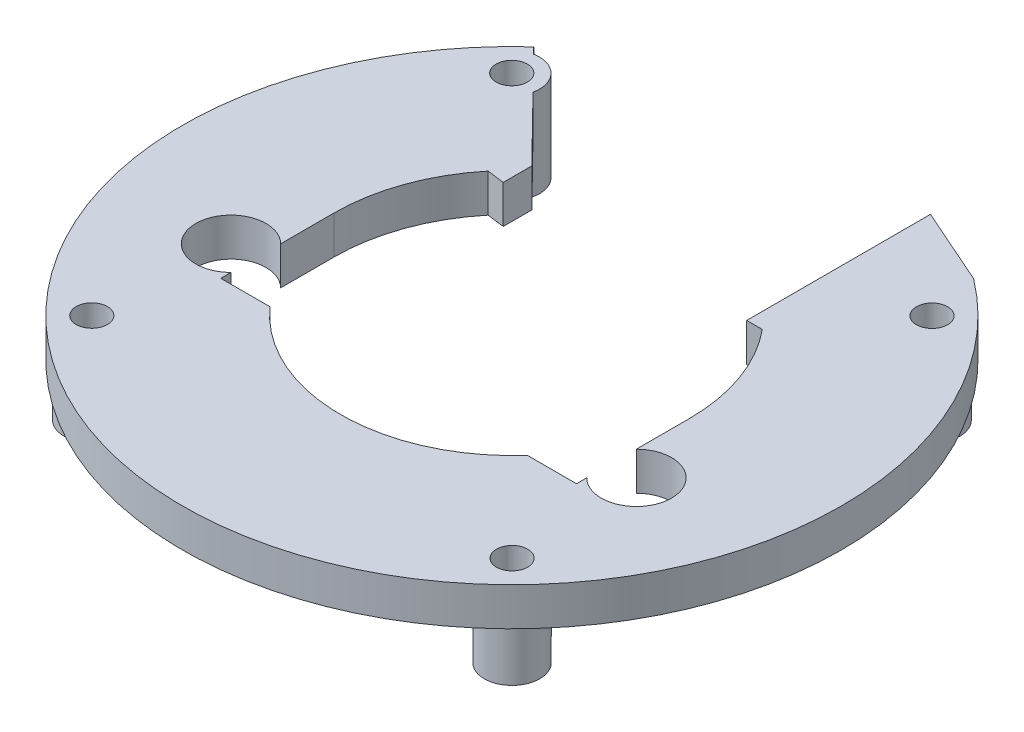
ISO-10303-21;
HEADER;
FILE_DESCRIPTION(('STEP AP214'),'2;1');
FILE_NAME('part.step','',(''),(''),'','','');
FILE_SCHEMA(('AUTOMOTIVE_DESIGN { 1 0 10303 214 1 1 1 1 }'));
ENDSEC;
DATA;
#1=APPLICATION_CONTEXT('core data for automotive mechanical design processes');
#2=APPLICATION_PROTOCOL_DEFINITION('international standard','automotive_design',2000,#1);
#3=PRODUCT_CONTEXT('',#1,'mechanical');
#4=PRODUCT('Part','Part','',(#3));
#5=PRODUCT_RELATED_PRODUCT_CATEGORY('part','',(#4));
#6=PRODUCT_DEFINITION_FORMATION('','',#4);
#7=PRODUCT_DEFINITION_CONTEXT('part definition',#1,'design');
#8=PRODUCT_DEFINITION('design','',#6,#7);
#9=PRODUCT_DEFINITION_SHAPE('','',#8);
#10=(LENGTH_UNIT() NAMED_UNIT(*) SI_UNIT(.MILLI.,.METRE.));
#11=(NAMED_UNIT(*) PLANE_ANGLE_UNIT() SI_UNIT($,.RADIAN.));
#12=(NAMED_UNIT(*) SI_UNIT($,.STERADIAN.) SOLID_ANGLE_UNIT());
#13=UNCERTAINTY_MEASURE_WITH_UNIT(LENGTH_MEASURE(1.E-05),#10,'distance_accuracy_value','');
#14=(GEOMETRIC_REPRESENTATION_CONTEXT(3) GLOBAL_UNCERTAINTY_ASSIGNED_CONTEXT((#13)) GLOBAL_UNIT_ASSIGNED_CONTEXT((#10,
#11,#12)) REPRESENTATION_CONTEXT('',''));
#15=CARTESIAN_POINT('',(0.,0.,0.));
#16=DIRECTION('',(0.,0.,1.));
#17=DIRECTION('',(1.,0.,0.));
#18=AXIS2_PLACEMENT_3D('',#15,#16,#17);
#19=CARTESIAN_POINT('',(0.,-5.588,0.));
#20=DIRECTION('',(0.,1.,0.));
#21=DIRECTION('',(0.,0.,1.));
#22=AXIS2_PLACEMENT_3D('',#19,#20,#21);
#23=PLANE('',#22);
#24=CARTESIAN_POINT('',(-30.7594,-5.588,30.7411010296903));
#25=DIRECTION('',(0.,1.,0.));
#26=DIRECTION('',(0.,0.,1.));
#27=AXIS2_PLACEMENT_3D('',#24,#25,#26);
#28=CIRCLE('',#27,4.06400000000001);
#29=CARTESIAN_POINT('',(-30.7594,-5.588,34.8051010296903));
#30=VERTEX_POINT('',#29);
#31=EDGE_CURVE('E533',#30,#30,#28,.F.);
#32=ORIENTED_EDGE('',*,*,#31,.F.);
#33=EDGE_LOOP('',(#32));
#34=FACE_BOUND('',#33,.T.);
#35=DIRECTION('',(-0.700354867966116,0.,-0.713794829706804));
#36=VECTOR('',#35,1.);
#37=CARTESIAN_POINT('',(1.28776269894874,-5.588,-1.26351556141755));
#38=LINE('',#37,#36);
#39=CARTESIAN_POINT('',(-31.5467271734712,-5.588,-34.7281064124198));
#40=VERTEX_POINT('',#39);
#41=CARTESIAN_POINT('',(-32.4776887690565,-5.588,-35.6769333628402));
#42=VERTEX_POINT('',#41);
#43=EDGE_CURVE('E458',#40,#42,#38,.T.);
#44=ORIENTED_EDGE('',*,*,#43,.F.);
#45=CARTESIAN_POINT('',(-30.7594,-5.588,-30.7411010296903));
#46=DIRECTION('',(0.,1.,0.));
#47=DIRECTION('',(0.,0.,1.));
#48=AXIS2_PLACEMENT_3D('',#45,#46,#47);
#49=CIRCLE('',#48,4.06400000000001);
#50=CARTESIAN_POINT('',(-26.7880788333373,-5.588,-29.8781385790488));
#51=VERTEX_POINT('',#50);
#52=EDGE_CURVE('E666',#40,#51,#49,.T.);
#53=ORIENTED_EDGE('',*,*,#52,.T.);
#54=CARTESIAN_POINT('',(-17.5260000000037,-5.588,-20.4383184450504));
#55=VERTEX_POINT('',#54);
#56=EDGE_CURVE('E459',#55,#51,#38,.T.);
#57=ORIENTED_EDGE('',*,*,#56,.F.);
#58=DIRECTION('',(0.,0.,1.));
#59=VECTOR('',#58,1.);
#60=CARTESIAN_POINT('',(-17.5260000000037,-5.588,0.));
#61=LINE('',#60,#59);
#62=CARTESIAN_POINT('',(-17.5260000000037,-5.588,-16.256));
#63=VERTEX_POINT('',#62);
#64=EDGE_CURVE('E456',#55,#63,#61,.T.);
#65=ORIENTED_EDGE('',*,*,#64,.T.);
#66=DIRECTION('',(-0.992032593835348,0.,-0.125981477877945));
#67=VECTOR('',#66,1.);
#68=CARTESIAN_POINT('',(1.75347703775627,-5.588,-13.8076358786755));
#69=LINE('',#68,#67);
#70=CARTESIAN_POINT('',(-20.0733983735918,-5.588,-16.5795024875622));
#71=VERTEX_POINT('',#70);
#72=EDGE_CURVE('E454',#63,#71,#69,.T.);
#73=ORIENTED_EDGE('',*,*,#72,.T.);
#74=CARTESIAN_POINT('',(0.,-5.588,0.));
#75=DIRECTION('',(0.,1.,0.));
#76=DIRECTION('',(0.,0.,1.));
#77=AXIS2_PLACEMENT_3D('',#74,#75,#76);
#78=CIRCLE('',#77,26.035);
#79=CARTESIAN_POINT('',(-26.035,-5.588,0.));
#80=VERTEX_POINT('',#79);
#81=EDGE_CURVE('E449',#71,#80,#78,.T.);
#82=ORIENTED_EDGE('',*,*,#81,.T.);
#83=DIRECTION('',(0.,0.,1.));
#84=VECTOR('',#83,1.);
#85=CARTESIAN_POINT('',(-26.035,-5.588,0.));
#86=LINE('',#85,#84);
#87=CARTESIAN_POINT('',(-26.035,-5.588,7.8211488360114));
#88=VERTEX_POINT('',#87);
#89=EDGE_CURVE('E446',#80,#88,#86,.T.);
#90=ORIENTED_EDGE('',*,*,#89,.T.);
#91=CARTESIAN_POINT('',(-29.6799,-5.588,11.4502391132021));
#92=DIRECTION('',(0.,1.,0.));
#93=DIRECTION('',(0.,0.,1.));
#94=AXIS2_PLACEMENT_3D('',#91,#92,#93);
#95=CIRCLE('',#94,5.1435);
#96=CARTESIAN_POINT('',(-26.035,-5.588,15.0793293903928));
#97=VERTEX_POINT('',#96);
#98=EDGE_CURVE('E428',#97,#88,#95,.F.);
#99=ORIENTED_EDGE('',*,*,#98,.F.);
#100=DIRECTION('',(0.,0.,1.));
#101=VECTOR('',#100,1.);
#102=CARTESIAN_POINT('',(-26.035,-5.588,0.));
#103=LINE('',#102,#101);
#104=CARTESIAN_POINT('',(-26.035,-5.588,16.5795024875622));
#105=VERTEX_POINT('',#104);
#106=EDGE_CURVE('E437',#97,#105,#103,.T.);
#107=ORIENTED_EDGE('',*,*,#106,.T.);
#108=DIRECTION('',(-1.,0.,0.));
#109=VECTOR('',#108,1.);
#110=CARTESIAN_POINT('',(0.,-5.588,16.5795024875621));
#111=LINE('',#110,#109);
#112=CARTESIAN_POINT('',(-18.8224240925247,-5.588,16.5795024875622));
#113=VERTEX_POINT('',#112);
#114=EDGE_CURVE('E435',#113,#105,#111,.T.);
#115=ORIENTED_EDGE('',*,*,#114,.F.);
#116=CARTESIAN_POINT('',(0.,-5.588,0.));
#117=DIRECTION('',(0.,1.,0.));
#118=DIRECTION('',(0.,0.,1.));
#119=AXIS2_PLACEMENT_3D('',#116,#117,#118);
#120=CIRCLE('',#119,25.083132807804);
#121=CARTESIAN_POINT('',(18.8224240925247,-5.588,16.5795024875622));
#122=VERTEX_POINT('',#121);
#123=EDGE_CURVE('E484',#113,#122,#120,.T.);
#124=ORIENTED_EDGE('',*,*,#123,.T.);
#125=DIRECTION('',(-1.,0.,0.));
#126=VECTOR('',#125,1.);
#127=CARTESIAN_POINT('',(0.,-5.588,16.5795024875622));
#128=LINE('',#127,#126);
#129=CARTESIAN_POINT('',(26.035,-5.588,16.5795024875622));
#130=VERTEX_POINT('',#129);
#131=EDGE_CURVE('E481',#130,#122,#128,.T.);
#132=ORIENTED_EDGE('',*,*,#131,.F.);
#133=DIRECTION('',(0.,0.,1.));
#134=VECTOR('',#133,1.);
#135=CARTESIAN_POINT('',(26.035,-5.588,0.));
#136=LINE('',#135,#134);
#137=CARTESIAN_POINT('',(26.035,-5.588,15.0793293903928));
#138=VERTEX_POINT('',#137);
#139=EDGE_CURVE('E478',#138,#130,#136,.T.);
#140=ORIENTED_EDGE('',*,*,#139,.F.);
#141=CARTESIAN_POINT('',(29.6799,-5.588,11.4502391132021));
#142=DIRECTION('',(0.,1.,0.));
#143=DIRECTION('',(0.,0.,1.));
#144=AXIS2_PLACEMENT_3D('',#141,#142,#143);
#145=CIRCLE('',#144,5.14350000000001);
#146=CARTESIAN_POINT('',(26.035,-5.588,7.8211488360114));
#147=VERTEX_POINT('',#146);
#148=EDGE_CURVE('E476',#138,#147,#145,.T.);
#149=ORIENTED_EDGE('',*,*,#148,.T.);
#150=DIRECTION('',(0.,0.,1.));
#151=VECTOR('',#150,1.);
#152=CARTESIAN_POINT('',(26.035,-5.588,0.));
#153=LINE('',#152,#151);
#154=CARTESIAN_POINT('',(26.035,-5.588,0.));
#155=VERTEX_POINT('',#154);
#156=EDGE_CURVE('E473',#155,#147,#153,.T.);
#157=ORIENTED_EDGE('',*,*,#156,.F.);
#158=CARTESIAN_POINT('',(0.,-5.588,0.));
#159=DIRECTION('',(0.,1.,0.));
#160=DIRECTION('',(0.,0.,1.));
#161=AXIS2_PLACEMENT_3D('',#158,#159,#160);
#162=CIRCLE('',#161,26.035);
#163=CARTESIAN_POINT('',(20.0733983735918,-5.588,-16.5795024875622));
#164=VERTEX_POINT('',#163);
#165=EDGE_CURVE('E471',#155,#164,#162,.T.);
#166=ORIENTED_EDGE('',*,*,#165,.T.);
#167=DIRECTION('',(-1.,0.,0.));
#168=VECTOR('',#167,1.);
#169=CARTESIAN_POINT('',(0.,-5.588,-16.5795024875622));
#170=LINE('',#169,#168);
#171=CARTESIAN_POINT('',(17.7906760658379,-5.588,-16.5795024875622));
#172=VERTEX_POINT('',#171);
#173=EDGE_CURVE('E469',#164,#172,#170,.T.);
#174=ORIENTED_EDGE('',*,*,#173,.T.);
#175=DIRECTION('',(0.,0.,-1.));
#176=VECTOR('',#175,1.);
#177=CARTESIAN_POINT('',(17.7906760658379,-5.588,0.));
#178=LINE('',#177,#176);
#179=CARTESIAN_POINT('',(17.7906760658379,-5.588,-43.4830360129035));
#180=VERTEX_POINT('',#179);
#181=EDGE_CURVE('E467',#172,#180,#178,.T.);
#182=ORIENTED_EDGE('',*,*,#181,.T.);
#183=DIRECTION('',(0.914664910906145,0.,0.404212939868399));
#184=VECTOR('',#183,1.);
#185=CARTESIAN_POINT('',(18.9833064380603,-5.588,-42.955983293176));
#186=LINE('',#185,#184);
#187=CARTESIAN_POINT('',(29.0886532750842,-5.588,-38.4901817688379));
#188=VERTEX_POINT('',#187);
#189=EDGE_CURVE('E465',#180,#188,#186,.T.);
#190=ORIENTED_EDGE('',*,*,#189,.T.);
#191=CARTESIAN_POINT('',(0.,-5.588,0.));
#192=DIRECTION('',(0.,1.,0.));
#193=DIRECTION('',(0.,0.,1.));
#194=AXIS2_PLACEMENT_3D('',#191,#192,#193);
#195=CIRCLE('',#194,48.2456613796126);
#196=EDGE_CURVE('E462',#42,#188,#195,.T.);
#197=ORIENTED_EDGE('',*,*,#196,.F.);
#198=EDGE_LOOP('',(#44,#53,#57,#65,#73,#82,#90,#99,#107,#115,#124,#132,#140,#149,#157,#166,#174,
#182,#190,#197));
#199=FACE_BOUND('',#198,.T.);
#200=CARTESIAN_POINT('',(30.7594,-5.588,30.7411010296903));
#201=DIRECTION('',(0.,1.,0.));
#202=DIRECTION('',(0.,0.,1.));
#203=AXIS2_PLACEMENT_3D('',#200,#201,#202);
#204=CIRCLE('',#203,4.06400000000001);
#205=CARTESIAN_POINT('',(30.7594,-5.588,34.8051010296903));
#206=VERTEX_POINT('',#205);
#207=EDGE_CURVE('E689',#206,#206,#204,.T.);
#208=ORIENTED_EDGE('',*,*,#207,.T.);
#209=EDGE_LOOP('',(#208));
#210=FACE_BOUND('',#209,.T.);
#211=CARTESIAN_POINT('',(30.7594,-5.588,-30.7411010296903));
#212=DIRECTION('',(0.,1.,0.));
#213=DIRECTION('',(0.,0.,1.));
#214=AXIS2_PLACEMENT_3D('',#211,#212,#213);
#215=CIRCLE('',#214,4.06400000000001);
#216=CARTESIAN_POINT('',(30.7594,-5.588,-26.6771010296903));
#217=VERTEX_POINT('',#216);
#218=EDGE_CURVE('E297',#217,#217,#215,.F.);
#219=ORIENTED_EDGE('',*,*,#218,.F.);
#220=EDGE_LOOP('',(#219));
#221=FACE_BOUND('',#220,.T.);
#222=ADVANCED_FACE('F289',(#34,#199,#210,#221),#23,.F.);
#223=CARTESIAN_POINT('',(1.28776269894874,-5.588,-1.26351556141755));
#224=DIRECTION('',(0.713794829706803,0.,-0.700354867966116));
#225=DIRECTION('',(-0.700354867966116,0.,-0.713794829706804));
#226=AXIS2_PLACEMENT_3D('',#223,#224,#225);
#227=PLANE('',#226);
#228=DIRECTION('',(0.,1.,0.));
#229=VECTOR('',#228,1.);
#230=CARTESIAN_POINT('',(-31.5467271734712,-13.2588,-34.7281064124198));
#231=LINE('',#230,#229);
#232=CARTESIAN_POINT('',(-31.5467271734712,0.,-34.7281064124198));
#233=VERTEX_POINT('',#232);
#234=EDGE_CURVE('E304',#40,#233,#231,.T.);
#235=ORIENTED_EDGE('',*,*,#234,.F.);
#236=ORIENTED_EDGE('',*,*,#43,.T.);
#237=DIRECTION('',(0.,1.,0.));
#238=VECTOR('',#237,1.);
#239=CARTESIAN_POINT('',(-32.4776887690565,-5.588,-35.6769333628402));
#240=LINE('',#239,#238);
#241=CARTESIAN_POINT('',(-32.4776887690565,0.,-35.6769333628402));
#242=VERTEX_POINT('',#241);
#243=EDGE_CURVE('E557',#42,#242,#240,.T.);
#244=ORIENTED_EDGE('',*,*,#243,.T.);
#245=DIRECTION('',(-0.700354867966116,0.,-0.713794829706804));
#246=VECTOR('',#245,1.);
#247=CARTESIAN_POINT('',(1.28776269894874,0.,-1.26351556141755));
#248=LINE('',#247,#246);
#249=EDGE_CURVE('E309',#233,#242,#248,.T.);
#250=ORIENTED_EDGE('',*,*,#249,.F.);
#251=EDGE_LOOP('',(#235,#236,#244,#250));
#252=FACE_BOUND('',#251,.T.);
#253=ADVANCED_FACE('F630',(#252),#227,.T.);
#254=CARTESIAN_POINT('',(0.,0.,0.));
#255=DIRECTION('',(0.,1.,0.));
#256=DIRECTION('',(0.,0.,1.));
#257=AXIS2_PLACEMENT_3D('',#254,#255,#256);
#258=PLANE('',#257);
#259=CARTESIAN_POINT('',(-30.7594,0.,-30.7411010296903));
#260=DIRECTION('',(0.,1.,0.));
#261=DIRECTION('',(0.,0.,1.));
#262=AXIS2_PLACEMENT_3D('',#259,#260,#261);
#263=CIRCLE('',#262,4.06400000000001);
#264=CARTESIAN_POINT('',(-26.7880788333373,0.,-29.8781385790488));
#265=VERTEX_POINT('',#264);
#266=EDGE_CURVE('E659',#265,#233,#263,.T.);
#267=ORIENTED_EDGE('',*,*,#266,.T.);
#268=ORIENTED_EDGE('',*,*,#249,.T.);
#269=CARTESIAN_POINT('',(0.,0.,0.));
#270=DIRECTION('',(0.,1.,0.));
#271=DIRECTION('',(0.,0.,1.));
#272=AXIS2_PLACEMENT_3D('',#269,#270,#271);
#273=CIRCLE('',#272,48.2456613796126);
#274=CARTESIAN_POINT('',(29.0886532750842,0.,-38.4901817688379));
#275=VERTEX_POINT('',#274);
#276=EDGE_CURVE('E503',#242,#275,#273,.T.);
#277=ORIENTED_EDGE('',*,*,#276,.T.);
#278=DIRECTION('',(0.914664910906145,0.,0.404212939868399));
#279=VECTOR('',#278,1.);
#280=CARTESIAN_POINT('',(18.9833064380603,0.,-42.955983293176));
#281=LINE('',#280,#279);
#282=CARTESIAN_POINT('',(17.7906760658379,0.,-43.4830360129035));
#283=VERTEX_POINT('',#282);
#284=EDGE_CURVE('E506',#283,#275,#281,.T.);
#285=ORIENTED_EDGE('',*,*,#284,.F.);
#286=DIRECTION('',(0.,0.,-1.));
#287=VECTOR('',#286,1.);
#288=CARTESIAN_POINT('',(17.7906760658379,0.,0.));
#289=LINE('',#288,#287);
#290=CARTESIAN_POINT('',(17.7906760658379,0.,-16.5795024875622));
#291=VERTEX_POINT('',#290);
#292=EDGE_CURVE('E509',#291,#283,#289,.T.);
#293=ORIENTED_EDGE('',*,*,#292,.F.);
#294=DIRECTION('',(-1.,0.,0.));
#295=VECTOR('',#294,1.);
#296=CARTESIAN_POINT('',(0.,0.,-16.5795024875622));
#297=LINE('',#296,#295);
#298=CARTESIAN_POINT('',(20.0733983735918,0.,-16.5795024875622));
#299=VERTEX_POINT('',#298);
#300=EDGE_CURVE('E511',#299,#291,#297,.T.);
#301=ORIENTED_EDGE('',*,*,#300,.F.);
#302=CARTESIAN_POINT('',(0.,0.,0.));
#303=DIRECTION('',(0.,1.,0.));
#304=DIRECTION('',(0.,0.,1.));
#305=AXIS2_PLACEMENT_3D('',#302,#303,#304);
#306=CIRCLE('',#305,26.035);
#307=CARTESIAN_POINT('',(26.035,0.,0.));
#308=VERTEX_POINT('',#307);
#309=EDGE_CURVE('E513',#308,#299,#306,.T.);
#310=ORIENTED_EDGE('',*,*,#309,.F.);
#311=DIRECTION('',(0.,0.,1.));
#312=VECTOR('',#311,1.);
#313=CARTESIAN_POINT('',(26.035,0.,0.));
#314=LINE('',#313,#312);
#315=CARTESIAN_POINT('',(26.035,0.,7.8211488360114));
#316=VERTEX_POINT('',#315);
#317=EDGE_CURVE('E515',#308,#316,#314,.T.);
#318=ORIENTED_EDGE('',*,*,#317,.T.);
#319=CARTESIAN_POINT('',(29.6799,0.,11.4502391132021));
#320=DIRECTION('',(0.,1.,0.));
#321=DIRECTION('',(0.,0.,1.));
#322=AXIS2_PLACEMENT_3D('',#319,#320,#321);
#323=CIRCLE('',#322,5.14350000000001);
#324=CARTESIAN_POINT('',(26.035,0.,15.0793293903928));
#325=VERTEX_POINT('',#324);
#326=EDGE_CURVE('E518',#325,#316,#323,.T.);
#327=ORIENTED_EDGE('',*,*,#326,.F.);
#328=DIRECTION('',(0.,0.,1.));
#329=VECTOR('',#328,1.);
#330=CARTESIAN_POINT('',(26.035,0.,0.));
#331=LINE('',#330,#329);
#332=CARTESIAN_POINT('',(26.035,0.,16.5795024875622));
#333=VERTEX_POINT('',#332);
#334=EDGE_CURVE('E521',#325,#333,#331,.T.);
#335=ORIENTED_EDGE('',*,*,#334,.T.);
#336=DIRECTION('',(-1.,0.,0.));
#337=VECTOR('',#336,1.);
#338=CARTESIAN_POINT('',(0.,0.,16.5795024875622));
#339=LINE('',#338,#337);
#340=CARTESIAN_POINT('',(18.8224240925247,0.,16.5795024875622));
#341=VERTEX_POINT('',#340);
#342=EDGE_CURVE('E524',#333,#341,#339,.T.);
#343=ORIENTED_EDGE('',*,*,#342,.T.);
#344=CARTESIAN_POINT('',(0.,0.,0.));
#345=DIRECTION('',(0.,1.,0.));
#346=DIRECTION('',(0.,0.,1.));
#347=AXIS2_PLACEMENT_3D('',#344,#345,#346);
#348=CIRCLE('',#347,25.083132807804);
#349=CARTESIAN_POINT('',(-18.8224240925247,0.,16.5795024875622));
#350=VERTEX_POINT('',#349);
#351=EDGE_CURVE('E527',#350,#341,#348,.T.);
#352=ORIENTED_EDGE('',*,*,#351,.F.);
#353=DIRECTION('',(-1.,0.,0.));
#354=VECTOR('',#353,1.);
#355=CARTESIAN_POINT('',(0.,0.,16.5795024875621));
#356=LINE('',#355,#354);
#357=CARTESIAN_POINT('',(-26.035,0.,16.5795024875622));
#358=VERTEX_POINT('',#357);
#359=EDGE_CURVE('E442',#350,#358,#356,.T.);
#360=ORIENTED_EDGE('',*,*,#359,.T.);
#361=DIRECTION('',(0.,0.,1.));
#362=VECTOR('',#361,1.);
#363=CARTESIAN_POINT('',(-26.035,0.,0.));
#364=LINE('',#363,#362);
#365=CARTESIAN_POINT('',(-26.035,0.,15.0793293903928));
#366=VERTEX_POINT('',#365);
#367=EDGE_CURVE('E487',#366,#358,#364,.T.);
#368=ORIENTED_EDGE('',*,*,#367,.F.);
#369=CARTESIAN_POINT('',(-29.6799,0.,11.4502391132021));
#370=DIRECTION('',(0.,1.,0.));
#371=DIRECTION('',(0.,0.,1.));
#372=AXIS2_PLACEMENT_3D('',#369,#370,#371);
#373=CIRCLE('',#372,5.1435);
#374=CARTESIAN_POINT('',(-26.035,0.,7.8211488360114));
#375=VERTEX_POINT('',#374);
#376=EDGE_CURVE('E430',#366,#375,#373,.F.);
#377=ORIENTED_EDGE('',*,*,#376,.T.);
#378=DIRECTION('',(0.,0.,1.));
#379=VECTOR('',#378,1.);
#380=CARTESIAN_POINT('',(-26.035,0.,0.));
#381=LINE('',#380,#379);
#382=CARTESIAN_POINT('',(-26.035,0.,0.));
#383=VERTEX_POINT('',#382);
#384=EDGE_CURVE('E491',#383,#375,#381,.T.);
#385=ORIENTED_EDGE('',*,*,#384,.F.);
#386=CARTESIAN_POINT('',(0.,0.,0.));
#387=DIRECTION('',(0.,1.,0.));
#388=DIRECTION('',(0.,0.,1.));
#389=AXIS2_PLACEMENT_3D('',#386,#387,#388);
#390=CIRCLE('',#389,26.035);
#391=CARTESIAN_POINT('',(-20.0733983735918,0.,-16.5795024875622));
#392=VERTEX_POINT('',#391);
#393=EDGE_CURVE('E494',#392,#383,#390,.T.);
#394=ORIENTED_EDGE('',*,*,#393,.F.);
#395=DIRECTION('',(-0.992032593835348,0.,-0.125981477877945));
#396=VECTOR('',#395,1.);
#397=CARTESIAN_POINT('',(1.75347703775627,0.,-13.8076358786755));
#398=LINE('',#397,#396);
#399=CARTESIAN_POINT('',(-17.5260000000037,0.,-16.256));
#400=VERTEX_POINT('',#399);
#401=EDGE_CURVE('E496',#400,#392,#398,.T.);
#402=ORIENTED_EDGE('',*,*,#401,.F.);
#403=DIRECTION('',(0.,0.,1.));
#404=VECTOR('',#403,1.);
#405=CARTESIAN_POINT('',(-17.5260000000037,0.,0.));
#406=LINE('',#405,#404);
#407=CARTESIAN_POINT('',(-17.5260000000037,0.,-20.4383184450504));
#408=VERTEX_POINT('',#407);
#409=EDGE_CURVE('E498',#408,#400,#406,.T.);
#410=ORIENTED_EDGE('',*,*,#409,.F.);
#411=EDGE_CURVE('E500',#408,#265,#248,.T.);
#412=ORIENTED_EDGE('',*,*,#411,.T.);
#413=EDGE_LOOP('',(#267,#268,#277,#285,#293,#301,#310,#318,#327,#335,#343,#352,#360,#368,#377,
#385,#394,#402,#410,#412));
#414=FACE_BOUND('',#413,.T.);
#415=CARTESIAN_POINT('',(30.7594,0.,-30.7373899783309));
#416=DIRECTION('',(0.,-1.,0.));
#417=DIRECTION('',(0.,0.,-1.));
#418=AXIS2_PLACEMENT_3D('',#415,#416,#417);
#419=CIRCLE('',#418,2.286);
#420=CARTESIAN_POINT('',(30.7594,0.,-33.0233899783309));
#421=VERTEX_POINT('',#420);
#422=EDGE_CURVE('E698',#421,#421,#419,.T.);
#423=ORIENTED_EDGE('',*,*,#422,.T.);
#424=EDGE_LOOP('',(#423));
#425=FACE_BOUND('',#424,.T.);
#426=CARTESIAN_POINT('',(30.7594,0.,30.7373899783309));
#427=DIRECTION('',(0.,1.,0.));
#428=DIRECTION('',(0.,0.,1.));
#429=AXIS2_PLACEMENT_3D('',#426,#427,#428);
#430=CIRCLE('',#429,2.286);
#431=CARTESIAN_POINT('',(30.7594,0.,33.0233899783309));
#432=VERTEX_POINT('',#431);
#433=EDGE_CURVE('E489',#432,#432,#430,.T.);
#434=ORIENTED_EDGE('',*,*,#433,.F.);
#435=EDGE_LOOP('',(#434));
#436=FACE_BOUND('',#435,.T.);
#437=CARTESIAN_POINT('',(-30.7594,0.,30.7373899783309));
#438=DIRECTION('',(0.,-1.,0.));
#439=DIRECTION('',(0.,0.,-1.));
#440=AXIS2_PLACEMENT_3D('',#437,#438,#439);
#441=CIRCLE('',#440,2.286);
#442=CARTESIAN_POINT('',(-30.7594,0.,28.4513899783309));
#443=VERTEX_POINT('',#442);
#444=EDGE_CURVE('E703',#443,#443,#441,.T.);
#445=ORIENTED_EDGE('',*,*,#444,.T.);
#446=EDGE_LOOP('',(#445));
#447=FACE_BOUND('',#446,.T.);
#448=CARTESIAN_POINT('',(-30.7594,0.,-30.7373899783309));
#449=DIRECTION('',(0.,1.,0.));
#450=DIRECTION('',(0.,0.,1.));
#451=AXIS2_PLACEMENT_3D('',#448,#449,#450);
#452=CIRCLE('',#451,2.286);
#453=CARTESIAN_POINT('',(-30.7594,0.,-28.4513899783309));
#454=VERTEX_POINT('',#453);
#455=EDGE_CURVE('E669',#454,#454,#452,.T.);
#456=ORIENTED_EDGE('',*,*,#455,.F.);
#457=EDGE_LOOP('',(#456));
#458=FACE_BOUND('',#457,.T.);
#459=ADVANCED_FACE('F577',(#414,#425,#436,#447,#458),#258,.T.);
#460=CARTESIAN_POINT('',(-26.035,-5.588,0.));
#461=DIRECTION('',(-1.,0.,0.));
#462=DIRECTION('',(0.,0.,1.));
#463=AXIS2_PLACEMENT_3D('',#460,#461,#462);
#464=PLANE('',#463);
#465=ORIENTED_EDGE('',*,*,#367,.T.);
#466=DIRECTION('',(0.,1.,0.));
#467=VECTOR('',#466,1.);
#468=CARTESIAN_POINT('',(-26.035,-5.588,16.5795024875622));
#469=LINE('',#468,#467);
#470=EDGE_CURVE('E438',#105,#358,#469,.T.);
#471=ORIENTED_EDGE('',*,*,#470,.F.);
#472=ORIENTED_EDGE('',*,*,#106,.F.);
#473=DIRECTION('',(0.,1.,0.));
#474=VECTOR('',#473,1.);
#475=CARTESIAN_POINT('',(-26.035,-5.588,15.0793293903928));
#476=LINE('',#475,#474);
#477=EDGE_CURVE('E424',#97,#366,#476,.T.);
#478=ORIENTED_EDGE('',*,*,#477,.T.);
#479=EDGE_LOOP('',(#465,#471,#472,#478));
#480=FACE_BOUND('',#479,.T.);
#481=ADVANCED_FACE('F291',(#480),#464,.F.);
#482=CARTESIAN_POINT('',(0.,-5.588,16.5795024875621));
#483=DIRECTION('',(0.,0.,-1.));
#484=DIRECTION('',(-1.,0.,0.));
#485=AXIS2_PLACEMENT_3D('',#482,#483,#484);
#486=PLANE('',#485);
#487=ORIENTED_EDGE('',*,*,#359,.F.);
#488=DIRECTION('',(0.,1.,0.));
#489=VECTOR('',#488,1.);
#490=CARTESIAN_POINT('',(-18.8224240925247,-5.588,16.5795024875622));
#491=LINE('',#490,#489);
#492=EDGE_CURVE('E534',#113,#350,#491,.T.);
#493=ORIENTED_EDGE('',*,*,#492,.F.);
#494=ORIENTED_EDGE('',*,*,#114,.T.);
#495=ORIENTED_EDGE('',*,*,#470,.T.);
#496=EDGE_LOOP('',(#487,#493,#494,#495));
#497=FACE_BOUND('',#496,.T.);
#498=ADVANCED_FACE('F582',(#497),#486,.T.);
#499=CARTESIAN_POINT('',(0.,-5.588,0.));
#500=DIRECTION('',(0.,1.,0.));
#501=DIRECTION('',(0.,0.,1.));
#502=AXIS2_PLACEMENT_3D('',#499,#500,#501);
#503=CYLINDRICAL_SURFACE('',#502,25.083132807804);
#504=ORIENTED_EDGE('',*,*,#351,.T.);
#505=DIRECTION('',(0.,1.,0.));
#506=VECTOR('',#505,1.);
#507=CARTESIAN_POINT('',(18.8224240925247,-5.588,16.5795024875622));
#508=LINE('',#507,#506);
#509=EDGE_CURVE('E536',#122,#341,#508,.T.);
#510=ORIENTED_EDGE('',*,*,#509,.F.);
#511=ORIENTED_EDGE('',*,*,#123,.F.);
#512=ORIENTED_EDGE('',*,*,#492,.T.);
#513=EDGE_LOOP('',(#504,#510,#511,#512));
#514=FACE_BOUND('',#513,.T.);
#515=ADVANCED_FACE('F588',(#514),#503,.F.);
#516=CARTESIAN_POINT('',(0.,-5.588,16.5795024875622));
#517=DIRECTION('',(0.,0.,-1.));
#518=DIRECTION('',(-1.,0.,0.));
#519=AXIS2_PLACEMENT_3D('',#516,#517,#518);
#520=PLANE('',#519);
#521=ORIENTED_EDGE('',*,*,#342,.F.);
#522=DIRECTION('',(0.,1.,0.));
#523=VECTOR('',#522,1.);
#524=CARTESIAN_POINT('',(26.035,-5.588,16.5795024875622));
#525=LINE('',#524,#523);
#526=EDGE_CURVE('E538',#130,#333,#525,.T.);
#527=ORIENTED_EDGE('',*,*,#526,.F.);
#528=ORIENTED_EDGE('',*,*,#131,.T.);
#529=ORIENTED_EDGE('',*,*,#509,.T.);
#530=EDGE_LOOP('',(#521,#527,#528,#529));
#531=FACE_BOUND('',#530,.T.);
#532=ADVANCED_FACE('F591',(#531),#520,.T.);
#533=CARTESIAN_POINT('',(26.035,-5.588,0.));
#534=DIRECTION('',(-1.,0.,0.));
#535=DIRECTION('',(0.,0.,1.));
#536=AXIS2_PLACEMENT_3D('',#533,#534,#535);
#537=PLANE('',#536);
#538=ORIENTED_EDGE('',*,*,#334,.F.);
#539=DIRECTION('',(0.,1.,0.));
#540=VECTOR('',#539,1.);
#541=CARTESIAN_POINT('',(26.035,-5.588,15.0793293903928));
#542=LINE('',#541,#540);
#543=EDGE_CURVE('E540',#138,#325,#542,.T.);
#544=ORIENTED_EDGE('',*,*,#543,.F.);
#545=ORIENTED_EDGE('',*,*,#139,.T.);
#546=ORIENTED_EDGE('',*,*,#526,.T.);
#547=EDGE_LOOP('',(#538,#544,#545,#546));
#548=FACE_BOUND('',#547,.T.);
#549=ADVANCED_FACE('F594',(#548),#537,.T.);
#550=CARTESIAN_POINT('',(29.6799,-5.588,11.4502391132021));
#551=DIRECTION('',(0.,1.,0.));
#552=DIRECTION('',(0.,0.,1.));
#553=AXIS2_PLACEMENT_3D('',#550,#551,#552);
#554=CYLINDRICAL_SURFACE('',#553,5.14350000000001);
#555=ORIENTED_EDGE('',*,*,#326,.T.);
#556=DIRECTION('',(0.,1.,0.));
#557=VECTOR('',#556,1.);
#558=CARTESIAN_POINT('',(26.035,-5.588,7.8211488360114));
#559=LINE('',#558,#557);
#560=EDGE_CURVE('E542',#147,#316,#559,.T.);
#561=ORIENTED_EDGE('',*,*,#560,.F.);
#562=ORIENTED_EDGE('',*,*,#148,.F.);
#563=ORIENTED_EDGE('',*,*,#543,.T.);
#564=EDGE_LOOP('',(#555,#561,#562,#563));
#565=FACE_BOUND('',#564,.T.);
#566=ADVANCED_FACE('F599',(#565),#554,.F.);
#567=CARTESIAN_POINT('',(26.035,-5.588,0.));
#568=DIRECTION('',(-1.,0.,0.));
#569=DIRECTION('',(0.,0.,1.));
#570=AXIS2_PLACEMENT_3D('',#567,#568,#569);
#571=PLANE('',#570);
#572=ORIENTED_EDGE('',*,*,#317,.F.);
#573=DIRECTION('',(0.,1.,0.));
#574=VECTOR('',#573,1.);
#575=CARTESIAN_POINT('',(26.035,-5.588,0.));
#576=LINE('',#575,#574);
#577=EDGE_CURVE('E544',#155,#308,#576,.T.);
#578=ORIENTED_EDGE('',*,*,#577,.F.);
#579=ORIENTED_EDGE('',*,*,#156,.T.);
#580=ORIENTED_EDGE('',*,*,#560,.T.);
#581=EDGE_LOOP('',(#572,#578,#579,#580));
#582=FACE_BOUND('',#581,.T.);
#583=ADVANCED_FACE('F603',(#582),#571,.T.);
#584=CARTESIAN_POINT('',(0.,-5.588,0.));
#585=DIRECTION('',(0.,1.,0.));
#586=DIRECTION('',(0.,0.,1.));
#587=AXIS2_PLACEMENT_3D('',#584,#585,#586);
#588=CYLINDRICAL_SURFACE('',#587,26.035);
#589=ORIENTED_EDGE('',*,*,#309,.T.);
#590=DIRECTION('',(0.,1.,0.));
#591=VECTOR('',#590,1.);
#592=CARTESIAN_POINT('',(20.0733983735918,-5.588,-16.5795024875622));
#593=LINE('',#592,#591);
#594=EDGE_CURVE('E546',#164,#299,#593,.T.);
#595=ORIENTED_EDGE('',*,*,#594,.F.);
#596=ORIENTED_EDGE('',*,*,#165,.F.);
#597=ORIENTED_EDGE('',*,*,#577,.T.);
#598=EDGE_LOOP('',(#589,#595,#596,#597));
#599=FACE_BOUND('',#598,.T.);
#600=ADVANCED_FACE('F608',(#599),#588,.F.);
#601=CARTESIAN_POINT('',(0.,-5.588,-16.5795024875622));
#602=DIRECTION('',(0.,0.,-1.));
#603=DIRECTION('',(-1.,0.,0.));
#604=AXIS2_PLACEMENT_3D('',#601,#602,#603);
#605=PLANE('',#604);
#606=ORIENTED_EDGE('',*,*,#300,.T.);
#607=DIRECTION('',(0.,1.,0.));
#608=VECTOR('',#607,1.);
#609=CARTESIAN_POINT('',(17.7906760658379,-5.588,-16.5795024875622));
#610=LINE('',#609,#608);
#611=EDGE_CURVE('E549',#172,#291,#610,.T.);
#612=ORIENTED_EDGE('',*,*,#611,.F.);
#613=ORIENTED_EDGE('',*,*,#173,.F.);
#614=ORIENTED_EDGE('',*,*,#594,.T.);
#615=EDGE_LOOP('',(#606,#612,#613,#614));
#616=FACE_BOUND('',#615,.T.);
#617=ADVANCED_FACE('F614',(#616),#605,.F.);
#618=CARTESIAN_POINT('',(17.7906760658379,-5.588,0.));
#619=DIRECTION('',(1.,0.,0.));
#620=DIRECTION('',(0.,0.,-1.));
#621=AXIS2_PLACEMENT_3D('',#618,#619,#620);
#622=PLANE('',#621);
#623=ORIENTED_EDGE('',*,*,#292,.T.);
#624=DIRECTION('',(0.,1.,0.));
#625=VECTOR('',#624,1.);
#626=CARTESIAN_POINT('',(17.7906760658379,-5.588,-43.4830360129035));
#627=LINE('',#626,#625);
#628=EDGE_CURVE('E552',#180,#283,#627,.T.);
#629=ORIENTED_EDGE('',*,*,#628,.F.);
#630=ORIENTED_EDGE('',*,*,#181,.F.);
#631=ORIENTED_EDGE('',*,*,#611,.T.);
#632=EDGE_LOOP('',(#623,#629,#630,#631));
#633=FACE_BOUND('',#632,.T.);
#634=ADVANCED_FACE('F618',(#633),#622,.F.);
#635=CARTESIAN_POINT('',(18.9833064380603,-5.588,-42.955983293176));
#636=DIRECTION('',(-0.404212939868399,0.,0.914664910906145));
#637=DIRECTION('',(0.914664910906145,0.,0.404212939868399));
#638=AXIS2_PLACEMENT_3D('',#635,#636,#637);
#639=PLANE('',#638);
#640=ORIENTED_EDGE('',*,*,#284,.T.);
#641=DIRECTION('',(0.,1.,0.));
#642=VECTOR('',#641,1.);
#643=CARTESIAN_POINT('',(29.0886532750842,-5.588,-38.4901817688379));
#644=LINE('',#643,#642);
#645=EDGE_CURVE('E555',#188,#275,#644,.T.);
#646=ORIENTED_EDGE('',*,*,#645,.F.);
#647=ORIENTED_EDGE('',*,*,#189,.F.);
#648=ORIENTED_EDGE('',*,*,#628,.T.);
#649=EDGE_LOOP('',(#640,#646,#647,#648));
#650=FACE_BOUND('',#649,.T.);
#651=ADVANCED_FACE('F623',(#650),#639,.F.);
#652=CARTESIAN_POINT('',(0.,-5.588,0.));
#653=DIRECTION('',(0.,1.,0.));
#654=DIRECTION('',(0.,0.,1.));
#655=AXIS2_PLACEMENT_3D('',#652,#653,#654);
#656=CYLINDRICAL_SURFACE('',#655,48.2456613796126);
#657=ORIENTED_EDGE('',*,*,#276,.F.);
#658=ORIENTED_EDGE('',*,*,#243,.F.);
#659=ORIENTED_EDGE('',*,*,#196,.T.);
#660=ORIENTED_EDGE('',*,*,#645,.T.);
#661=EDGE_LOOP('',(#657,#658,#659,#660));
#662=FACE_BOUND('',#661,.T.);
#663=ADVANCED_FACE('F629',(#662),#656,.T.);
#664=DIRECTION('',(0.,1.,0.));
#665=VECTOR('',#664,1.);
#666=CARTESIAN_POINT('',(-26.7880788333373,-13.2588,-29.8781385790488));
#667=LINE('',#666,#665);
#668=EDGE_CURVE('E12',#265,#51,#667,.F.);
#669=ORIENTED_EDGE('',*,*,#668,.F.);
#670=ORIENTED_EDGE('',*,*,#411,.F.);
#671=DIRECTION('',(0.,1.,0.));
#672=VECTOR('',#671,1.);
#673=CARTESIAN_POINT('',(-17.5260000000037,-5.588,-20.4383184450504));
#674=LINE('',#673,#672);
#675=EDGE_CURVE('E559',#55,#408,#674,.T.);
#676=ORIENTED_EDGE('',*,*,#675,.F.);
#677=ORIENTED_EDGE('',*,*,#56,.T.);
#678=EDGE_LOOP('',(#669,#670,#676,#677));
#679=FACE_BOUND('',#678,.T.);
#680=ADVANCED_FACE('F633',(#679),#227,.T.);
#681=CARTESIAN_POINT('',(-17.5260000000037,-5.588,0.));
#682=DIRECTION('',(-1.,0.,0.));
#683=DIRECTION('',(0.,0.,1.));
#684=AXIS2_PLACEMENT_3D('',#681,#682,#683);
#685=PLANE('',#684);
#686=ORIENTED_EDGE('',*,*,#409,.T.);
#687=DIRECTION('',(0.,1.,0.));
#688=VECTOR('',#687,1.);
#689=CARTESIAN_POINT('',(-17.5260000000037,-5.588,-16.256));
#690=LINE('',#689,#688);
#691=EDGE_CURVE('E561',#63,#400,#690,.T.);
#692=ORIENTED_EDGE('',*,*,#691,.F.);
#693=ORIENTED_EDGE('',*,*,#64,.F.);
#694=ORIENTED_EDGE('',*,*,#675,.T.);
#695=EDGE_LOOP('',(#686,#692,#693,#694));
#696=FACE_BOUND('',#695,.T.);
#697=ADVANCED_FACE('F645',(#696),#685,.F.);
#698=CARTESIAN_POINT('',(1.75347703775627,-5.588,-13.8076358786755));
#699=DIRECTION('',(0.125981477877945,0.,-0.992032593835348));
#700=DIRECTION('',(-0.992032593835348,0.,-0.125981477877945));
#701=AXIS2_PLACEMENT_3D('',#698,#699,#700);
#702=PLANE('',#701);
#703=ORIENTED_EDGE('',*,*,#401,.T.);
#704=DIRECTION('',(0.,1.,0.));
#705=VECTOR('',#704,1.);
#706=CARTESIAN_POINT('',(-20.0733983735918,-5.588,-16.5795024875622));
#707=LINE('',#706,#705);
#708=EDGE_CURVE('E564',#71,#392,#707,.T.);
#709=ORIENTED_EDGE('',*,*,#708,.F.);
#710=ORIENTED_EDGE('',*,*,#72,.F.);
#711=ORIENTED_EDGE('',*,*,#691,.T.);
#712=EDGE_LOOP('',(#703,#709,#710,#711));
#713=FACE_BOUND('',#712,.T.);
#714=ADVANCED_FACE('F651',(#713),#702,.F.);
#715=CARTESIAN_POINT('',(0.,-5.588,0.));
#716=DIRECTION('',(0.,1.,0.));
#717=DIRECTION('',(0.,0.,1.));
#718=AXIS2_PLACEMENT_3D('',#715,#716,#717);
#719=CYLINDRICAL_SURFACE('',#718,26.035);
#720=ORIENTED_EDGE('',*,*,#393,.T.);
#721=DIRECTION('',(0.,1.,0.));
#722=VECTOR('',#721,1.);
#723=CARTESIAN_POINT('',(-26.035,-5.588,0.));
#724=LINE('',#723,#722);
#725=EDGE_CURVE('E567',#80,#383,#724,.T.);
#726=ORIENTED_EDGE('',*,*,#725,.F.);
#727=ORIENTED_EDGE('',*,*,#81,.F.);
#728=ORIENTED_EDGE('',*,*,#708,.T.);
#729=EDGE_LOOP('',(#720,#726,#727,#728));
#730=FACE_BOUND('',#729,.T.);
#731=ADVANCED_FACE('F807',(#730),#719,.F.);
#732=CARTESIAN_POINT('',(-26.035,-5.588,0.));
#733=DIRECTION('',(-1.,0.,0.));
#734=DIRECTION('',(0.,0.,1.));
#735=AXIS2_PLACEMENT_3D('',#732,#733,#734);
#736=PLANE('',#735);
#737=ORIENTED_EDGE('',*,*,#384,.T.);
#738=DIRECTION('',(0.,1.,0.));
#739=VECTOR('',#738,1.);
#740=CARTESIAN_POINT('',(-26.035,-5.588,7.8211488360114));
#741=LINE('',#740,#739);
#742=EDGE_CURVE('E434',#88,#375,#741,.T.);
#743=ORIENTED_EDGE('',*,*,#742,.F.);
#744=ORIENTED_EDGE('',*,*,#89,.F.);
#745=ORIENTED_EDGE('',*,*,#725,.T.);
#746=EDGE_LOOP('',(#737,#743,#744,#745));
#747=FACE_BOUND('',#746,.T.);
#748=ADVANCED_FACE('F572',(#747),#736,.F.);
#749=CARTESIAN_POINT('',(-29.6799,-5.588,11.4502391132021));
#750=DIRECTION('',(0.,1.,0.));
#751=DIRECTION('',(0.,0.,1.));
#752=AXIS2_PLACEMENT_3D('',#749,#750,#751);
#753=CYLINDRICAL_SURFACE('',#752,5.1435);
#754=ORIENTED_EDGE('',*,*,#376,.F.);
#755=ORIENTED_EDGE('',*,*,#477,.F.);
#756=ORIENTED_EDGE('',*,*,#98,.T.);
#757=ORIENTED_EDGE('',*,*,#742,.T.);
#758=EDGE_LOOP('',(#754,#755,#756,#757));
#759=FACE_BOUND('',#758,.T.);
#760=ADVANCED_FACE('F426',(#759),#753,.F.);
#761=CARTESIAN_POINT('',(30.7594,-5.588,30.7373899783309));
#762=DIRECTION('',(0.,1.,0.));
#763=DIRECTION('',(0.,0.,1.));
#764=AXIS2_PLACEMENT_3D('',#761,#762,#763);
#765=CYLINDRICAL_SURFACE('',#764,2.286);
#766=ORIENTED_EDGE('',*,*,#433,.T.);
#767=EDGE_LOOP('',(#766));
#768=FACE_BOUND('',#767,.T.);
#769=CARTESIAN_POINT('',(30.7594,-13.2588,30.7373899783309));
#770=DIRECTION('',(0.,1.,0.));
#771=DIRECTION('',(0.,0.,-1.));
#772=AXIS2_PLACEMENT_3D('',#769,#770,#771);
#773=CIRCLE('',#772,2.286);
#774=CARTESIAN_POINT('',(30.7594,-13.2588,28.4513899783309));
#775=VERTEX_POINT('',#774);
#776=EDGE_CURVE('E681',#775,#775,#773,.T.);
#777=ORIENTED_EDGE('',*,*,#776,.F.);
#778=EDGE_LOOP('',(#777));
#779=FACE_BOUND('',#778,.T.);
#780=ADVANCED_FACE('F708',(#768,#779),#765,.F.);
#781=CARTESIAN_POINT('',(-30.7594,-5.588,30.7373899783309));
#782=DIRECTION('',(0.,1.,0.));
#783=DIRECTION('',(0.,0.,1.));
#784=AXIS2_PLACEMENT_3D('',#781,#782,#783);
#785=CYLINDRICAL_SURFACE('',#784,2.286);
#786=ORIENTED_EDGE('',*,*,#444,.F.);
#787=EDGE_LOOP('',(#786));
#788=FACE_BOUND('',#787,.T.);
#789=CARTESIAN_POINT('',(-30.7594,-13.2588,30.7373899783309));
#790=DIRECTION('',(0.,-1.,0.));
#791=DIRECTION('',(0.,0.,-1.));
#792=AXIS2_PLACEMENT_3D('',#789,#790,#791);
#793=CIRCLE('',#792,2.286);
#794=CARTESIAN_POINT('',(-30.7594,-13.2588,28.4513899783309));
#795=VERTEX_POINT('',#794);
#796=EDGE_CURVE('E692',#795,#795,#793,.T.);
#797=ORIENTED_EDGE('',*,*,#796,.T.);
#798=EDGE_LOOP('',(#797));
#799=FACE_BOUND('',#798,.T.);
#800=ADVANCED_FACE('F759',(#788,#799),#785,.F.);
#801=CARTESIAN_POINT('',(30.7594,-5.588,-30.7373899783309));
#802=DIRECTION('',(0.,1.,0.));
#803=DIRECTION('',(0.,0.,1.));
#804=AXIS2_PLACEMENT_3D('',#801,#802,#803);
#805=CYLINDRICAL_SURFACE('',#804,2.286);
#806=ORIENTED_EDGE('',*,*,#422,.F.);
#807=EDGE_LOOP('',(#806));
#808=FACE_BOUND('',#807,.T.);
#809=CARTESIAN_POINT('',(30.7594,-13.2588,-30.7373899783309));
#810=DIRECTION('',(0.,-1.,0.));
#811=DIRECTION('',(0.,0.,1.));
#812=AXIS2_PLACEMENT_3D('',#809,#810,#811);
#813=CIRCLE('',#812,2.286);
#814=CARTESIAN_POINT('',(30.7594,-13.2588,-28.4513899783309));
#815=VERTEX_POINT('',#814);
#816=EDGE_CURVE('E675',#815,#815,#813,.T.);
#817=ORIENTED_EDGE('',*,*,#816,.T.);
#818=EDGE_LOOP('',(#817));
#819=FACE_BOUND('',#818,.T.);
#820=ADVANCED_FACE('F755',(#808,#819),#805,.F.);
#821=CARTESIAN_POINT('',(-30.7594,-13.2588,30.7411010296903));
#822=DIRECTION('',(0.,1.,0.));
#823=DIRECTION('',(0.,0.,1.));
#824=AXIS2_PLACEMENT_3D('',#821,#822,#823);
#825=CYLINDRICAL_SURFACE('',#824,4.06400000000001);
#826=CARTESIAN_POINT('',(-30.7594,-13.2588,30.7411010296903));
#827=DIRECTION('',(0.,-1.,0.));
#828=DIRECTION('',(0.,0.,-1.));
#829=AXIS2_PLACEMENT_3D('',#826,#827,#828);
#830=CIRCLE('',#829,4.06400000000001);
#831=CARTESIAN_POINT('',(-30.7594,-13.2588,26.6771010296903));
#832=VERTEX_POINT('',#831);
#833=EDGE_CURVE('E695',#832,#832,#830,.T.);
#834=ORIENTED_EDGE('',*,*,#833,.F.);
#835=EDGE_LOOP('',(#834));
#836=FACE_BOUND('',#835,.T.);
#837=ORIENTED_EDGE('',*,*,#31,.T.);
#838=EDGE_LOOP('',(#837));
#839=FACE_BOUND('',#838,.T.);
#840=ADVANCED_FACE('F751',(#836,#839),#825,.T.);
#841=CARTESIAN_POINT('',(-30.7594,-13.2588,30.7411010296903));
#842=DIRECTION('',(0.,-1.,0.));
#843=DIRECTION('',(0.,0.,-1.));
#844=AXIS2_PLACEMENT_3D('',#841,#842,#843);
#845=PLANE('',#844);
#846=ORIENTED_EDGE('',*,*,#833,.T.);
#847=EDGE_LOOP('',(#846));
#848=FACE_BOUND('',#847,.T.);
#849=ORIENTED_EDGE('',*,*,#796,.F.);
#850=EDGE_LOOP('',(#849));
#851=FACE_BOUND('',#850,.T.);
#852=ADVANCED_FACE('F747',(#848,#851),#845,.T.);
#853=CARTESIAN_POINT('',(30.7594,-13.2588,30.7411010296903));
#854=DIRECTION('',(0.,1.,0.));
#855=DIRECTION('',(0.,0.,1.));
#856=AXIS2_PLACEMENT_3D('',#853,#854,#855);
#857=CYLINDRICAL_SURFACE('',#856,4.06400000000001);
#858=CARTESIAN_POINT('',(30.7594,-13.2588,30.7411010296903));
#859=DIRECTION('',(0.,1.,0.));
#860=DIRECTION('',(0.,0.,-1.));
#861=AXIS2_PLACEMENT_3D('',#858,#859,#860);
#862=CIRCLE('',#861,4.06400000000001);
#863=CARTESIAN_POINT('',(30.7594,-13.2588,26.6771010296903));
#864=VERTEX_POINT('',#863);
#865=EDGE_CURVE('E686',#864,#864,#862,.T.);
#866=ORIENTED_EDGE('',*,*,#865,.T.);
#867=EDGE_LOOP('',(#866));
#868=FACE_BOUND('',#867,.T.);
#869=ORIENTED_EDGE('',*,*,#207,.F.);
#870=EDGE_LOOP('',(#869));
#871=FACE_BOUND('',#870,.T.);
#872=ADVANCED_FACE('F743',(#868,#871),#857,.T.);
#873=CARTESIAN_POINT('',(30.7594,-13.2588,30.7411010296903));
#874=DIRECTION('',(0.,-1.,0.));
#875=DIRECTION('',(0.,0.,-1.));
#876=AXIS2_PLACEMENT_3D('',#873,#874,#875);
#877=PLANE('',#876);
#878=ORIENTED_EDGE('',*,*,#776,.T.);
#879=EDGE_LOOP('',(#878));
#880=FACE_BOUND('',#879,.T.);
#881=ORIENTED_EDGE('',*,*,#865,.F.);
#882=EDGE_LOOP('',(#881));
#883=FACE_BOUND('',#882,.T.);
#884=ADVANCED_FACE('F739',(#880,#883),#877,.T.);
#885=CARTESIAN_POINT('',(30.7594,-13.2588,-30.7411010296903));
#886=DIRECTION('',(0.,1.,0.));
#887=DIRECTION('',(0.,0.,1.));
#888=AXIS2_PLACEMENT_3D('',#885,#886,#887);
#889=CYLINDRICAL_SURFACE('',#888,4.06400000000001);
#890=CARTESIAN_POINT('',(30.7594,-13.2588,-30.7411010296903));
#891=DIRECTION('',(0.,-1.,0.));
#892=DIRECTION('',(0.,0.,1.));
#893=AXIS2_PLACEMENT_3D('',#890,#891,#892);
#894=CIRCLE('',#893,4.06400000000001);
#895=CARTESIAN_POINT('',(30.7594,-13.2588,-26.6771010296903));
#896=VERTEX_POINT('',#895);
#897=EDGE_CURVE('E678',#896,#896,#894,.T.);
#898=ORIENTED_EDGE('',*,*,#897,.F.);
#899=EDGE_LOOP('',(#898));
#900=FACE_BOUND('',#899,.T.);
#901=ORIENTED_EDGE('',*,*,#218,.T.);
#902=EDGE_LOOP('',(#901));
#903=FACE_BOUND('',#902,.T.);
#904=ADVANCED_FACE('F735',(#900,#903),#889,.T.);
#905=CARTESIAN_POINT('',(30.7594,-13.2588,-30.7411010296903));
#906=DIRECTION('',(0.,-1.,0.));
#907=DIRECTION('',(0.,0.,1.));
#908=AXIS2_PLACEMENT_3D('',#905,#906,#907);
#909=PLANE('',#908);
#910=ORIENTED_EDGE('',*,*,#897,.T.);
#911=EDGE_LOOP('',(#910));
#912=FACE_BOUND('',#911,.T.);
#913=ORIENTED_EDGE('',*,*,#816,.F.);
#914=EDGE_LOOP('',(#913));
#915=FACE_BOUND('',#914,.T.);
#916=ADVANCED_FACE('F731',(#912,#915),#909,.T.);
#917=CARTESIAN_POINT('',(-30.7594,-13.2588,-30.7411010296903));
#918=DIRECTION('',(0.,1.,0.));
#919=DIRECTION('',(0.,0.,1.));
#920=AXIS2_PLACEMENT_3D('',#917,#918,#919);
#921=CYLINDRICAL_SURFACE('',#920,4.06400000000001);
#922=CARTESIAN_POINT('',(-30.7594,-13.2588,-30.7411010296903));
#923=DIRECTION('',(0.,1.,0.));
#924=DIRECTION('',(0.,0.,1.));
#925=AXIS2_PLACEMENT_3D('',#922,#923,#924);
#926=CIRCLE('',#925,4.06400000000001);
#927=CARTESIAN_POINT('',(-30.7594,-13.2588,-26.6771010296903));
#928=VERTEX_POINT('',#927);
#929=EDGE_CURVE('E662',#928,#928,#926,.T.);
#930=ORIENTED_EDGE('',*,*,#929,.T.);
#931=EDGE_LOOP('',(#930));
#932=FACE_BOUND('',#931,.T.);
#933=ORIENTED_EDGE('',*,*,#52,.F.);
#934=ORIENTED_EDGE('',*,*,#234,.T.);
#935=ORIENTED_EDGE('',*,*,#266,.F.);
#936=ORIENTED_EDGE('',*,*,#668,.T.);
#937=EDGE_LOOP('',(#933,#934,#935,#936));
#938=FACE_BOUND('',#937,.T.);
#939=ADVANCED_FACE('F661',(#932,#938),#921,.T.);
#940=CARTESIAN_POINT('',(-30.7594,-13.2588,-30.7411010296903));
#941=DIRECTION('',(0.,-1.,0.));
#942=DIRECTION('',(0.,0.,1.));
#943=AXIS2_PLACEMENT_3D('',#940,#941,#942);
#944=PLANE('',#943);
#945=CARTESIAN_POINT('',(-30.7594,-13.2588,-30.7373899783309));
#946=DIRECTION('',(0.,1.,0.));
#947=DIRECTION('',(0.,0.,1.));
#948=AXIS2_PLACEMENT_3D('',#945,#946,#947);
#949=CIRCLE('',#948,2.286);
#950=CARTESIAN_POINT('',(-30.7594,-13.2588,-28.4513899783309));
#951=VERTEX_POINT('',#950);
#952=EDGE_CURVE('E663',#951,#951,#949,.T.);
#953=ORIENTED_EDGE('',*,*,#952,.T.);
#954=EDGE_LOOP('',(#953));
#955=FACE_BOUND('',#954,.T.);
#956=ORIENTED_EDGE('',*,*,#929,.F.);
#957=EDGE_LOOP('',(#956));
#958=FACE_BOUND('',#957,.T.);
#959=ADVANCED_FACE('F719',(#955,#958),#944,.T.);
#960=CARTESIAN_POINT('',(-30.7594,-13.2588,-30.7373899783309));
#961=DIRECTION('',(0.,1.,0.));
#962=DIRECTION('',(0.,0.,1.));
#963=AXIS2_PLACEMENT_3D('',#960,#961,#962);
#964=CYLINDRICAL_SURFACE('',#963,2.286);
#965=ORIENTED_EDGE('',*,*,#952,.F.);
#966=EDGE_LOOP('',(#965));
#967=FACE_BOUND('',#966,.T.);
#968=ORIENTED_EDGE('',*,*,#455,.T.);
#969=EDGE_LOOP('',(#968));
#970=FACE_BOUND('',#969,.T.);
#971=ADVANCED_FACE('F717',(#967,#970),#964,.F.);
#972=CLOSED_SHELL('',(#222,#253,#459,#481,#498,#515,#532,#549,#566,#583,#600,#617,#634,#651,
#663,#680,#697,#714,#731,#748,#760,#780,#800,#820,#840,#852,#872,#884,#904,#916,#939,#959,#971));
#973=MANIFOLD_SOLID_BREP('B2',#972);
#974=ADVANCED_BREP_SHAPE_REPRESENTATION('',(#18,#973),#14);
#975=SHAPE_DEFINITION_REPRESENTATION(#9,#974);
ENDSEC;
END-ISO-10303-21;
